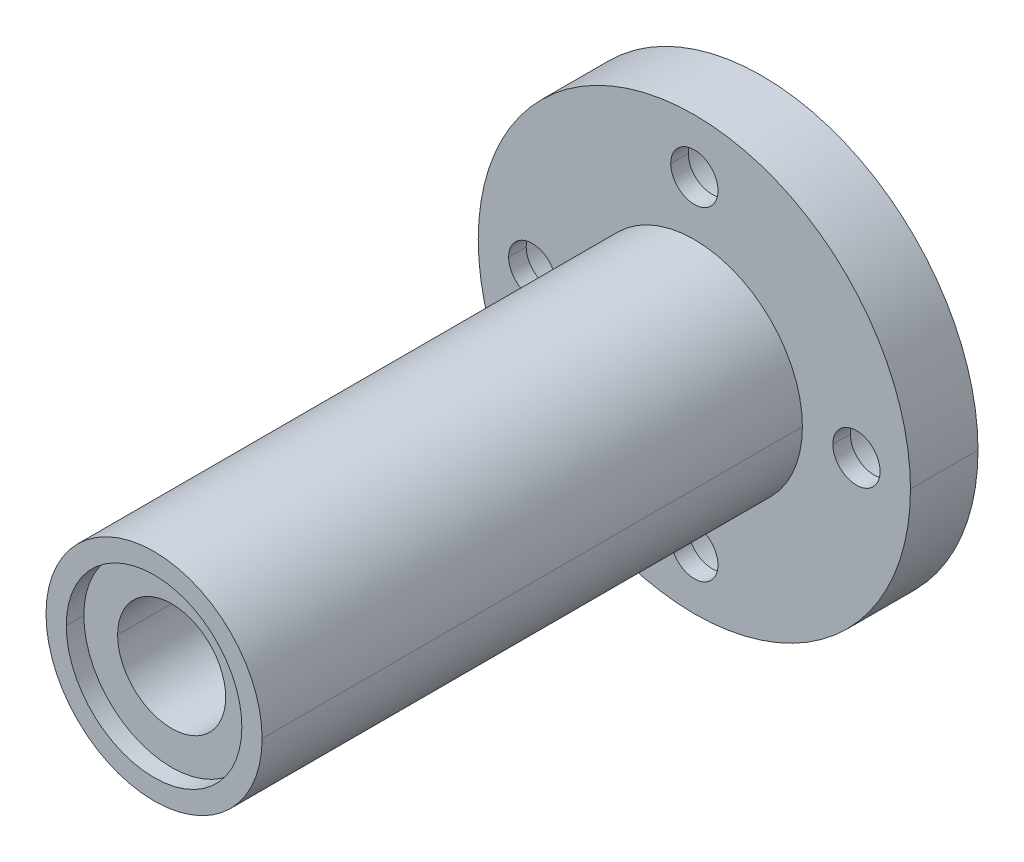
ISO-10303-21;
HEADER;
FILE_DESCRIPTION(('STEP AP214'),'2;1');
FILE_NAME('part.step','',(''),(''),'','','');
FILE_SCHEMA(('AUTOMOTIVE_DESIGN { 1 0 10303 214 1 1 1 1 }'));
ENDSEC;
DATA;
#1=APPLICATION_CONTEXT('core data for automotive mechanical design processes');
#2=APPLICATION_PROTOCOL_DEFINITION('international standard','automotive_design',2000,#1);
#3=PRODUCT_CONTEXT('',#1,'mechanical');
#4=PRODUCT('Part','Part','',(#3));
#5=PRODUCT_RELATED_PRODUCT_CATEGORY('part','',(#4));
#6=PRODUCT_DEFINITION_FORMATION('','',#4);
#7=PRODUCT_DEFINITION_CONTEXT('part definition',#1,'design');
#8=PRODUCT_DEFINITION('design','',#6,#7);
#9=PRODUCT_DEFINITION_SHAPE('','',#8);
#10=(LENGTH_UNIT() NAMED_UNIT(*) SI_UNIT(.MILLI.,.METRE.));
#11=(NAMED_UNIT(*) PLANE_ANGLE_UNIT() SI_UNIT($,.RADIAN.));
#12=(NAMED_UNIT(*) SI_UNIT($,.STERADIAN.) SOLID_ANGLE_UNIT());
#13=UNCERTAINTY_MEASURE_WITH_UNIT(LENGTH_MEASURE(1.E-05),#10,'distance_accuracy_value','');
#14=(GEOMETRIC_REPRESENTATION_CONTEXT(3) GLOBAL_UNCERTAINTY_ASSIGNED_CONTEXT((#13)) GLOBAL_UNIT_ASSIGNED_CONTEXT((#10,
#11,#12)) REPRESENTATION_CONTEXT('',''));
#15=CARTESIAN_POINT('',(0.,0.,0.));
#16=DIRECTION('',(0.,0.,1.));
#17=DIRECTION('',(1.,0.,0.));
#18=AXIS2_PLACEMENT_3D('',#15,#16,#17);
#19=CARTESIAN_POINT('',(12.,0.,0.));
#20=DIRECTION('',(0.,0.,-1.));
#21=DIRECTION('',(-1.,0.,0.));
#22=AXIS2_PLACEMENT_3D('',#19,#20,#21);
#23=CYLINDRICAL_SURFACE('',#22,3.25);
#24=DIRECTION('',(0.,0.,-1.));
#25=VECTOR('',#24,1.);
#26=CARTESIAN_POINT('',(15.25,0.,0.));
#27=LINE('',#26,#25);
#28=CARTESIAN_POINT('',(15.25,0.,3.7));
#29=VERTEX_POINT('',#28);
#30=CARTESIAN_POINT('',(15.25,0.,0.));
#31=VERTEX_POINT('',#30);
#32=EDGE_CURVE('E406',#29,#31,#27,.T.);
#33=ORIENTED_EDGE('',*,*,#32,.F.);
#34=CARTESIAN_POINT('',(12.,0.,3.7));
#35=DIRECTION('',(0.,0.,-1.));
#36=DIRECTION('',(-1.,0.,0.));
#37=AXIS2_PLACEMENT_3D('',#34,#35,#36);
#38=CIRCLE('',#37,3.25);
#39=CARTESIAN_POINT('',(8.75,0.,3.7));
#40=VERTEX_POINT('',#39);
#41=EDGE_CURVE('E10',#40,#29,#38,.T.);
#42=ORIENTED_EDGE('',*,*,#41,.F.);
#43=DIRECTION('',(0.,0.,-1.));
#44=VECTOR('',#43,1.);
#45=CARTESIAN_POINT('',(8.75,0.,0.));
#46=LINE('',#45,#44);
#47=CARTESIAN_POINT('',(8.75,0.,0.));
#48=VERTEX_POINT('',#47);
#49=EDGE_CURVE('E317',#40,#48,#46,.T.);
#50=ORIENTED_EDGE('',*,*,#49,.T.);
#51=CARTESIAN_POINT('',(12.,0.,0.));
#52=DIRECTION('',(0.,0.,-1.));
#53=DIRECTION('',(-1.,0.,0.));
#54=AXIS2_PLACEMENT_3D('',#51,#52,#53);
#55=CIRCLE('',#54,3.25);
#56=EDGE_CURVE('E410',#48,#31,#55,.T.);
#57=ORIENTED_EDGE('',*,*,#56,.T.);
#58=EDGE_LOOP('',(#33,#42,#50,#57));
#59=FACE_BOUND('',#58,.T.);
#60=ADVANCED_FACE('F15',(#59),#23,.F.);
#61=CARTESIAN_POINT('',(13.75,0.,3.7));
#62=DIRECTION('',(0.,0.,1.));
#63=DIRECTION('',(1.,0.,0.));
#64=AXIS2_PLACEMENT_3D('',#61,#62,#63);
#65=PLANE('',#64);
#66=CARTESIAN_POINT('',(12.,0.,3.7));
#67=DIRECTION('',(0.,0.,-1.));
#68=DIRECTION('',(-1.,0.,0.));
#69=AXIS2_PLACEMENT_3D('',#66,#67,#68);
#70=CIRCLE('',#69,1.75);
#71=CARTESIAN_POINT('',(10.25,0.,3.7));
#72=VERTEX_POINT('',#71);
#73=CARTESIAN_POINT('',(13.75,0.,3.7));
#74=VERTEX_POINT('',#73);
#75=EDGE_CURVE('E26',#72,#74,#70,.T.);
#76=ORIENTED_EDGE('',*,*,#75,.F.);
#77=CARTESIAN_POINT('',(12.,0.,3.7));
#78=DIRECTION('',(0.,0.,-1.));
#79=DIRECTION('',(-1.,0.,0.));
#80=AXIS2_PLACEMENT_3D('',#77,#78,#79);
#81=CIRCLE('',#80,1.75);
#82=EDGE_CURVE('E436',#74,#72,#81,.T.);
#83=ORIENTED_EDGE('',*,*,#82,.F.);
#84=EDGE_LOOP('',(#76,#83));
#85=FACE_BOUND('',#84,.T.);
#86=ORIENTED_EDGE('',*,*,#41,.T.);
#87=CARTESIAN_POINT('',(12.,0.,3.7));
#88=DIRECTION('',(0.,0.,-1.));
#89=DIRECTION('',(-1.,0.,0.));
#90=AXIS2_PLACEMENT_3D('',#87,#88,#89);
#91=CIRCLE('',#90,3.25);
#92=EDGE_CURVE('E450',#29,#40,#91,.T.);
#93=ORIENTED_EDGE('',*,*,#92,.T.);
#94=EDGE_LOOP('',(#86,#93));
#95=FACE_BOUND('',#94,.T.);
#96=ADVANCED_FACE('F831',(#85,#95),#65,.F.);
#97=CARTESIAN_POINT('',(12.,0.,0.));
#98=DIRECTION('',(0.,0.,-1.));
#99=DIRECTION('',(-1.,0.,0.));
#100=AXIS2_PLACEMENT_3D('',#97,#98,#99);
#101=CYLINDRICAL_SURFACE('',#100,1.75);
#102=DIRECTION('',(0.,0.,-1.));
#103=VECTOR('',#102,1.);
#104=CARTESIAN_POINT('',(13.75,0.,0.));
#105=LINE('',#104,#103);
#106=CARTESIAN_POINT('',(13.75,0.,5.));
#107=VERTEX_POINT('',#106);
#108=EDGE_CURVE('E440',#107,#74,#105,.T.);
#109=ORIENTED_EDGE('',*,*,#108,.F.);
#110=CARTESIAN_POINT('',(12.,0.,5.));
#111=DIRECTION('',(0.,0.,1.));
#112=DIRECTION('',(1.,0.,0.));
#113=AXIS2_PLACEMENT_3D('',#110,#111,#112);
#114=CIRCLE('',#113,1.75);
#115=CARTESIAN_POINT('',(10.25,0.,5.));
#116=VERTEX_POINT('',#115);
#117=EDGE_CURVE('E242',#107,#116,#114,.T.);
#118=ORIENTED_EDGE('',*,*,#117,.T.);
#119=DIRECTION('',(0.,0.,-1.));
#120=VECTOR('',#119,1.);
#121=CARTESIAN_POINT('',(10.25,0.,0.));
#122=LINE('',#121,#120);
#123=EDGE_CURVE('E316',#116,#72,#122,.T.);
#124=ORIENTED_EDGE('',*,*,#123,.T.);
#125=ORIENTED_EDGE('',*,*,#75,.T.);
#126=EDGE_LOOP('',(#109,#118,#124,#125));
#127=FACE_BOUND('',#126,.T.);
#128=ADVANCED_FACE('F882',(#127),#101,.F.);
#129=CARTESIAN_POINT('',(0.,-12.,0.));
#130=DIRECTION('',(0.,0.,-1.));
#131=DIRECTION('',(-1.,0.,0.));
#132=AXIS2_PLACEMENT_3D('',#129,#130,#131);
#133=CYLINDRICAL_SURFACE('',#132,3.25);
#134=DIRECTION('',(0.,0.,-1.));
#135=VECTOR('',#134,1.);
#136=CARTESIAN_POINT('',(3.25,-12.,0.));
#137=LINE('',#136,#135);
#138=CARTESIAN_POINT('',(3.25,-12.,3.7));
#139=VERTEX_POINT('',#138);
#140=CARTESIAN_POINT('',(3.25,-12.,0.));
#141=VERTEX_POINT('',#140);
#142=EDGE_CURVE('E315',#139,#141,#137,.T.);
#143=ORIENTED_EDGE('',*,*,#142,.F.);
#144=CARTESIAN_POINT('',(0.,-12.,3.7));
#145=DIRECTION('',(0.,0.,-1.));
#146=DIRECTION('',(-1.,0.,0.));
#147=AXIS2_PLACEMENT_3D('',#144,#145,#146);
#148=CIRCLE('',#147,3.25);
#149=CARTESIAN_POINT('',(-3.25,-12.,3.7));
#150=VERTEX_POINT('',#149);
#151=EDGE_CURVE('E377',#150,#139,#148,.T.);
#152=ORIENTED_EDGE('',*,*,#151,.F.);
#153=DIRECTION('',(0.,0.,-1.));
#154=VECTOR('',#153,1.);
#155=CARTESIAN_POINT('',(-3.25,-12.,0.));
#156=LINE('',#155,#154);
#157=CARTESIAN_POINT('',(-3.25,-12.,0.));
#158=VERTEX_POINT('',#157);
#159=EDGE_CURVE('E255',#150,#158,#156,.T.);
#160=ORIENTED_EDGE('',*,*,#159,.T.);
#161=CARTESIAN_POINT('',(0.,-12.,0.));
#162=DIRECTION('',(0.,0.,-1.));
#163=DIRECTION('',(-1.,0.,0.));
#164=AXIS2_PLACEMENT_3D('',#161,#162,#163);
#165=CIRCLE('',#164,3.25);
#166=EDGE_CURVE('E424',#158,#141,#165,.T.);
#167=ORIENTED_EDGE('',*,*,#166,.T.);
#168=EDGE_LOOP('',(#143,#152,#160,#167));
#169=FACE_BOUND('',#168,.T.);
#170=ADVANCED_FACE('F772',(#169),#133,.F.);
#171=CARTESIAN_POINT('',(1.75,-12.,3.7));
#172=DIRECTION('',(0.,0.,1.));
#173=DIRECTION('',(1.,0.,0.));
#174=AXIS2_PLACEMENT_3D('',#171,#172,#173);
#175=PLANE('',#174);
#176=CARTESIAN_POINT('',(0.,-12.,3.7));
#177=DIRECTION('',(0.,0.,-1.));
#178=DIRECTION('',(-1.,0.,0.));
#179=AXIS2_PLACEMENT_3D('',#176,#177,#178);
#180=CIRCLE('',#179,1.75);
#181=CARTESIAN_POINT('',(-1.75,-12.,3.7));
#182=VERTEX_POINT('',#181);
#183=CARTESIAN_POINT('',(1.75,-12.,3.7));
#184=VERTEX_POINT('',#183);
#185=EDGE_CURVE('E246',#182,#184,#180,.T.);
#186=ORIENTED_EDGE('',*,*,#185,.F.);
#187=CARTESIAN_POINT('',(0.,-12.,3.7));
#188=DIRECTION('',(0.,0.,-1.));
#189=DIRECTION('',(-1.,0.,0.));
#190=AXIS2_PLACEMENT_3D('',#187,#188,#189);
#191=CIRCLE('',#190,1.75);
#192=EDGE_CURVE('E251',#184,#182,#191,.T.);
#193=ORIENTED_EDGE('',*,*,#192,.F.);
#194=EDGE_LOOP('',(#186,#193));
#195=FACE_BOUND('',#194,.T.);
#196=ORIENTED_EDGE('',*,*,#151,.T.);
#197=CARTESIAN_POINT('',(0.,-12.,3.7));
#198=DIRECTION('',(0.,0.,-1.));
#199=DIRECTION('',(-1.,0.,0.));
#200=AXIS2_PLACEMENT_3D('',#197,#198,#199);
#201=CIRCLE('',#200,3.25);
#202=EDGE_CURVE('E311',#139,#150,#201,.T.);
#203=ORIENTED_EDGE('',*,*,#202,.T.);
#204=EDGE_LOOP('',(#196,#203));
#205=FACE_BOUND('',#204,.T.);
#206=ADVANCED_FACE('F768',(#195,#205),#175,.F.);
#207=CARTESIAN_POINT('',(0.,-12.,0.));
#208=DIRECTION('',(0.,0.,-1.));
#209=DIRECTION('',(-1.,0.,0.));
#210=AXIS2_PLACEMENT_3D('',#207,#208,#209);
#211=CYLINDRICAL_SURFACE('',#210,1.75);
#212=DIRECTION('',(0.,0.,-1.));
#213=VECTOR('',#212,1.);
#214=CARTESIAN_POINT('',(1.75,-12.,0.));
#215=LINE('',#214,#213);
#216=CARTESIAN_POINT('',(1.75,-12.,5.));
#217=VERTEX_POINT('',#216);
#218=EDGE_CURVE('E19',#217,#184,#215,.T.);
#219=ORIENTED_EDGE('',*,*,#218,.F.);
#220=CARTESIAN_POINT('',(0.,-12.,5.));
#221=DIRECTION('',(0.,0.,1.));
#222=DIRECTION('',(1.,0.,0.));
#223=AXIS2_PLACEMENT_3D('',#220,#221,#222);
#224=CIRCLE('',#223,1.75);
#225=CARTESIAN_POINT('',(-1.75,-12.,5.));
#226=VERTEX_POINT('',#225);
#227=EDGE_CURVE('E231',#217,#226,#224,.T.);
#228=ORIENTED_EDGE('',*,*,#227,.T.);
#229=DIRECTION('',(0.,0.,-1.));
#230=VECTOR('',#229,1.);
#231=CARTESIAN_POINT('',(-1.75,-12.,0.));
#232=LINE('',#231,#230);
#233=EDGE_CURVE('E253',#226,#182,#232,.T.);
#234=ORIENTED_EDGE('',*,*,#233,.T.);
#235=ORIENTED_EDGE('',*,*,#185,.T.);
#236=EDGE_LOOP('',(#219,#228,#234,#235));
#237=FACE_BOUND('',#236,.T.);
#238=ADVANCED_FACE('F245',(#237),#211,.F.);
#239=CARTESIAN_POINT('',(-12.,0.,0.));
#240=DIRECTION('',(0.,0.,-1.));
#241=DIRECTION('',(-1.,0.,0.));
#242=AXIS2_PLACEMENT_3D('',#239,#240,#241);
#243=CYLINDRICAL_SURFACE('',#242,3.25);
#244=DIRECTION('',(0.,0.,-1.));
#245=VECTOR('',#244,1.);
#246=CARTESIAN_POINT('',(-8.75,0.,0.));
#247=LINE('',#246,#245);
#248=CARTESIAN_POINT('',(-8.75,0.,3.7));
#249=VERTEX_POINT('',#248);
#250=CARTESIAN_POINT('',(-8.75,0.,0.));
#251=VERTEX_POINT('',#250);
#252=EDGE_CURVE('E343',#249,#251,#247,.T.);
#253=ORIENTED_EDGE('',*,*,#252,.F.);
#254=CARTESIAN_POINT('',(-12.,0.,3.7));
#255=DIRECTION('',(0.,0.,-1.));
#256=DIRECTION('',(-1.,0.,0.));
#257=AXIS2_PLACEMENT_3D('',#254,#255,#256);
#258=CIRCLE('',#257,3.25);
#259=CARTESIAN_POINT('',(-15.25,0.,3.7));
#260=VERTEX_POINT('',#259);
#261=EDGE_CURVE('E336',#260,#249,#258,.T.);
#262=ORIENTED_EDGE('',*,*,#261,.F.);
#263=DIRECTION('',(0.,0.,-1.));
#264=VECTOR('',#263,1.);
#265=CARTESIAN_POINT('',(-15.25,0.,0.));
#266=LINE('',#265,#264);
#267=CARTESIAN_POINT('',(-15.25,0.,0.));
#268=VERTEX_POINT('',#267);
#269=EDGE_CURVE('E360',#260,#268,#266,.T.);
#270=ORIENTED_EDGE('',*,*,#269,.T.);
#271=CARTESIAN_POINT('',(-12.,0.,0.));
#272=DIRECTION('',(0.,0.,-1.));
#273=DIRECTION('',(-1.,0.,0.));
#274=AXIS2_PLACEMENT_3D('',#271,#272,#273);
#275=CIRCLE('',#274,3.25);
#276=EDGE_CURVE('E298',#268,#251,#275,.T.);
#277=ORIENTED_EDGE('',*,*,#276,.T.);
#278=EDGE_LOOP('',(#253,#262,#270,#277));
#279=FACE_BOUND('',#278,.T.);
#280=ADVANCED_FACE('F781',(#279),#243,.F.);
#281=CARTESIAN_POINT('',(-10.25,0.,3.7));
#282=DIRECTION('',(0.,0.,1.));
#283=DIRECTION('',(1.,0.,0.));
#284=AXIS2_PLACEMENT_3D('',#281,#282,#283);
#285=PLANE('',#284);
#286=CARTESIAN_POINT('',(-12.,0.,3.7));
#287=DIRECTION('',(0.,0.,-1.));
#288=DIRECTION('',(-1.,0.,0.));
#289=AXIS2_PLACEMENT_3D('',#286,#287,#288);
#290=CIRCLE('',#289,1.75);
#291=CARTESIAN_POINT('',(-13.75,0.,3.7));
#292=VERTEX_POINT('',#291);
#293=CARTESIAN_POINT('',(-10.25,0.,3.7));
#294=VERTEX_POINT('',#293);
#295=EDGE_CURVE('E326',#292,#294,#290,.T.);
#296=ORIENTED_EDGE('',*,*,#295,.F.);
#297=CARTESIAN_POINT('',(-12.,0.,3.7));
#298=DIRECTION('',(0.,0.,-1.));
#299=DIRECTION('',(-1.,0.,0.));
#300=AXIS2_PLACEMENT_3D('',#297,#298,#299);
#301=CIRCLE('',#300,1.75);
#302=EDGE_CURVE('E373',#294,#292,#301,.T.);
#303=ORIENTED_EDGE('',*,*,#302,.F.);
#304=EDGE_LOOP('',(#296,#303));
#305=FACE_BOUND('',#304,.T.);
#306=ORIENTED_EDGE('',*,*,#261,.T.);
#307=CARTESIAN_POINT('',(-12.,0.,3.7));
#308=DIRECTION('',(0.,0.,-1.));
#309=DIRECTION('',(-1.,0.,0.));
#310=AXIS2_PLACEMENT_3D('',#307,#308,#309);
#311=CIRCLE('',#310,3.25);
#312=EDGE_CURVE('E339',#249,#260,#311,.T.);
#313=ORIENTED_EDGE('',*,*,#312,.T.);
#314=EDGE_LOOP('',(#306,#313));
#315=FACE_BOUND('',#314,.T.);
#316=ADVANCED_FACE('F545',(#305,#315),#285,.F.);
#317=CARTESIAN_POINT('',(-12.,0.,0.));
#318=DIRECTION('',(0.,0.,-1.));
#319=DIRECTION('',(-1.,0.,0.));
#320=AXIS2_PLACEMENT_3D('',#317,#318,#319);
#321=CYLINDRICAL_SURFACE('',#320,1.75);
#322=DIRECTION('',(0.,0.,-1.));
#323=VECTOR('',#322,1.);
#324=CARTESIAN_POINT('',(-10.25,0.,0.));
#325=LINE('',#324,#323);
#326=CARTESIAN_POINT('',(-10.25,0.,5.));
#327=VERTEX_POINT('',#326);
#328=EDGE_CURVE('E359',#327,#294,#325,.T.);
#329=ORIENTED_EDGE('',*,*,#328,.F.);
#330=CARTESIAN_POINT('',(-12.,0.,5.));
#331=DIRECTION('',(0.,0.,1.));
#332=DIRECTION('',(1.,0.,0.));
#333=AXIS2_PLACEMENT_3D('',#330,#331,#332);
#334=CIRCLE('',#333,1.75);
#335=CARTESIAN_POINT('',(-13.75,0.,5.));
#336=VERTEX_POINT('',#335);
#337=EDGE_CURVE('E241',#327,#336,#334,.T.);
#338=ORIENTED_EDGE('',*,*,#337,.T.);
#339=DIRECTION('',(0.,0.,-1.));
#340=VECTOR('',#339,1.);
#341=CARTESIAN_POINT('',(-13.75,0.,0.));
#342=LINE('',#341,#340);
#343=EDGE_CURVE('E310',#336,#292,#342,.T.);
#344=ORIENTED_EDGE('',*,*,#343,.T.);
#345=ORIENTED_EDGE('',*,*,#295,.T.);
#346=EDGE_LOOP('',(#329,#338,#344,#345));
#347=FACE_BOUND('',#346,.T.);
#348=ADVANCED_FACE('F549',(#347),#321,.F.);
#349=CARTESIAN_POINT('',(0.,12.,0.));
#350=DIRECTION('',(0.,0.,-1.));
#351=DIRECTION('',(-1.,0.,0.));
#352=AXIS2_PLACEMENT_3D('',#349,#350,#351);
#353=CYLINDRICAL_SURFACE('',#352,3.25);
#354=DIRECTION('',(0.,0.,-1.));
#355=VECTOR('',#354,1.);
#356=CARTESIAN_POINT('',(3.25,12.,0.));
#357=LINE('',#356,#355);
#358=CARTESIAN_POINT('',(3.25,12.,3.7));
#359=VERTEX_POINT('',#358);
#360=CARTESIAN_POINT('',(3.25,12.,0.));
#361=VERTEX_POINT('',#360);
#362=EDGE_CURVE('E309',#359,#361,#357,.T.);
#363=ORIENTED_EDGE('',*,*,#362,.F.);
#364=CARTESIAN_POINT('',(0.,12.,3.7));
#365=DIRECTION('',(0.,0.,-1.));
#366=DIRECTION('',(-1.,0.,0.));
#367=AXIS2_PLACEMENT_3D('',#364,#365,#366);
#368=CIRCLE('',#367,3.25);
#369=CARTESIAN_POINT('',(-3.25,12.,3.7));
#370=VERTEX_POINT('',#369);
#371=EDGE_CURVE('E323',#370,#359,#368,.T.);
#372=ORIENTED_EDGE('',*,*,#371,.F.);
#373=DIRECTION('',(0.,0.,-1.));
#374=VECTOR('',#373,1.);
#375=CARTESIAN_POINT('',(-3.25,12.,0.));
#376=LINE('',#375,#374);
#377=CARTESIAN_POINT('',(-3.25,12.,0.));
#378=VERTEX_POINT('',#377);
#379=EDGE_CURVE('E277',#370,#378,#376,.T.);
#380=ORIENTED_EDGE('',*,*,#379,.T.);
#381=CARTESIAN_POINT('',(0.,12.,0.));
#382=DIRECTION('',(0.,0.,-1.));
#383=DIRECTION('',(-1.,0.,0.));
#384=AXIS2_PLACEMENT_3D('',#381,#382,#383);
#385=CIRCLE('',#384,3.25);
#386=EDGE_CURVE('E294',#378,#361,#385,.T.);
#387=ORIENTED_EDGE('',*,*,#386,.T.);
#388=EDGE_LOOP('',(#363,#372,#380,#387));
#389=FACE_BOUND('',#388,.T.);
#390=ADVANCED_FACE('F844',(#389),#353,.F.);
#391=CARTESIAN_POINT('',(1.75,12.,3.7));
#392=DIRECTION('',(0.,0.,1.));
#393=DIRECTION('',(1.,0.,0.));
#394=AXIS2_PLACEMENT_3D('',#391,#392,#393);
#395=PLANE('',#394);
#396=CARTESIAN_POINT('',(0.,12.,3.7));
#397=DIRECTION('',(0.,0.,-1.));
#398=DIRECTION('',(-1.,0.,0.));
#399=AXIS2_PLACEMENT_3D('',#396,#397,#398);
#400=CIRCLE('',#399,1.75);
#401=CARTESIAN_POINT('',(-1.75,12.,3.7));
#402=VERTEX_POINT('',#401);
#403=CARTESIAN_POINT('',(1.75,12.,3.7));
#404=VERTEX_POINT('',#403);
#405=EDGE_CURVE('E327',#402,#404,#400,.T.);
#406=ORIENTED_EDGE('',*,*,#405,.F.);
#407=CARTESIAN_POINT('',(0.,12.,3.7));
#408=DIRECTION('',(0.,0.,-1.));
#409=DIRECTION('',(-1.,0.,0.));
#410=AXIS2_PLACEMENT_3D('',#407,#408,#409);
#411=CIRCLE('',#410,1.75);
#412=EDGE_CURVE('E389',#404,#402,#411,.T.);
#413=ORIENTED_EDGE('',*,*,#412,.F.);
#414=EDGE_LOOP('',(#406,#413));
#415=FACE_BOUND('',#414,.T.);
#416=ORIENTED_EDGE('',*,*,#371,.T.);
#417=CARTESIAN_POINT('',(0.,12.,3.7));
#418=DIRECTION('',(0.,0.,-1.));
#419=DIRECTION('',(-1.,0.,0.));
#420=AXIS2_PLACEMENT_3D('',#417,#418,#419);
#421=CIRCLE('',#420,3.25);
#422=EDGE_CURVE('E305',#359,#370,#421,.T.);
#423=ORIENTED_EDGE('',*,*,#422,.T.);
#424=EDGE_LOOP('',(#416,#423));
#425=FACE_BOUND('',#424,.T.);
#426=ADVANCED_FACE('F848',(#415,#425),#395,.F.);
#427=CARTESIAN_POINT('',(0.,12.,0.));
#428=DIRECTION('',(0.,0.,-1.));
#429=DIRECTION('',(-1.,0.,0.));
#430=AXIS2_PLACEMENT_3D('',#427,#428,#429);
#431=CYLINDRICAL_SURFACE('',#430,1.75);
#432=DIRECTION('',(0.,0.,-1.));
#433=VECTOR('',#432,1.);
#434=CARTESIAN_POINT('',(1.75,12.,0.));
#435=LINE('',#434,#433);
#436=CARTESIAN_POINT('',(1.75,12.,5.));
#437=VERTEX_POINT('',#436);
#438=EDGE_CURVE('E276',#437,#404,#435,.T.);
#439=ORIENTED_EDGE('',*,*,#438,.F.);
#440=CARTESIAN_POINT('',(0.,12.,5.));
#441=DIRECTION('',(0.,0.,1.));
#442=DIRECTION('',(1.,0.,0.));
#443=AXIS2_PLACEMENT_3D('',#440,#441,#442);
#444=CIRCLE('',#443,1.75);
#445=CARTESIAN_POINT('',(-1.75,12.,5.));
#446=VERTEX_POINT('',#445);
#447=EDGE_CURVE('E301',#437,#446,#444,.T.);
#448=ORIENTED_EDGE('',*,*,#447,.T.);
#449=DIRECTION('',(0.,0.,-1.));
#450=VECTOR('',#449,1.);
#451=CARTESIAN_POINT('',(-1.75,12.,0.));
#452=LINE('',#451,#450);
#453=EDGE_CURVE('E333',#446,#402,#452,.T.);
#454=ORIENTED_EDGE('',*,*,#453,.T.);
#455=ORIENTED_EDGE('',*,*,#405,.T.);
#456=EDGE_LOOP('',(#439,#448,#454,#455));
#457=FACE_BOUND('',#456,.T.);
#458=ADVANCED_FACE('F17',(#457),#431,.F.);
#459=CARTESIAN_POINT('',(4.,0.,1.3));
#460=DIRECTION('',(0.,0.,1.));
#461=DIRECTION('',(1.,0.,0.));
#462=AXIS2_PLACEMENT_3D('',#459,#460,#461);
#463=PLANE('',#462);
#464=CARTESIAN_POINT('',(0.,0.,1.3));
#465=DIRECTION('',(0.,0.,1.));
#466=DIRECTION('',(1.,0.,0.));
#467=AXIS2_PLACEMENT_3D('',#464,#465,#466);
#468=CIRCLE('',#467,4.);
#469=CARTESIAN_POINT('',(4.,0.,1.3));
#470=VERTEX_POINT('',#469);
#471=CARTESIAN_POINT('',(-4.,0.,1.3));
#472=VERTEX_POINT('',#471);
#473=EDGE_CURVE('E190',#470,#472,#468,.T.);
#474=ORIENTED_EDGE('',*,*,#473,.T.);
#475=CARTESIAN_POINT('',(0.,0.,1.3));
#476=DIRECTION('',(0.,0.,1.));
#477=DIRECTION('',(1.,0.,0.));
#478=AXIS2_PLACEMENT_3D('',#475,#476,#477);
#479=CIRCLE('',#478,4.);
#480=EDGE_CURVE('E328',#472,#470,#479,.T.);
#481=ORIENTED_EDGE('',*,*,#480,.T.);
#482=EDGE_LOOP('',(#474,#481));
#483=FACE_BOUND('',#482,.T.);
#484=CARTESIAN_POINT('',(0.,0.,1.3));
#485=DIRECTION('',(0.,0.,1.));
#486=DIRECTION('',(1.,0.,0.));
#487=AXIS2_PLACEMENT_3D('',#484,#485,#486);
#488=CIRCLE('',#487,6.5);
#489=CARTESIAN_POINT('',(6.5,0.,1.3));
#490=VERTEX_POINT('',#489);
#491=CARTESIAN_POINT('',(-6.5,0.,1.3));
#492=VERTEX_POINT('',#491);
#493=EDGE_CURVE('E282',#490,#492,#488,.T.);
#494=ORIENTED_EDGE('',*,*,#493,.F.);
#495=CARTESIAN_POINT('',(0.,0.,1.3));
#496=DIRECTION('',(0.,0.,1.));
#497=DIRECTION('',(1.,0.,0.));
#498=AXIS2_PLACEMENT_3D('',#495,#496,#497);
#499=CIRCLE('',#498,6.5);
#500=EDGE_CURVE('E347',#492,#490,#499,.T.);
#501=ORIENTED_EDGE('',*,*,#500,.F.);
#502=EDGE_LOOP('',(#494,#501));
#503=FACE_BOUND('',#502,.T.);
#504=ADVANCED_FACE('F936',(#483,#503),#463,.F.);
#505=CARTESIAN_POINT('',(0.,0.,0.));
#506=DIRECTION('',(0.,0.,1.));
#507=DIRECTION('',(1.,0.,0.));
#508=AXIS2_PLACEMENT_3D('',#505,#506,#507);
#509=CYLINDRICAL_SURFACE('',#508,4.);
#510=DIRECTION('',(0.,0.,1.));
#511=VECTOR('',#510,1.);
#512=CARTESIAN_POINT('',(-4.,0.,0.));
#513=LINE('',#512,#511);
#514=CARTESIAN_POINT('',(-4.,0.,43.7));
#515=VERTEX_POINT('',#514);
#516=EDGE_CURVE('E332',#472,#515,#513,.T.);
#517=ORIENTED_EDGE('',*,*,#516,.F.);
#518=ORIENTED_EDGE('',*,*,#473,.F.);
#519=DIRECTION('',(0.,0.,1.));
#520=VECTOR('',#519,1.);
#521=CARTESIAN_POINT('',(4.,0.,0.));
#522=LINE('',#521,#520);
#523=CARTESIAN_POINT('',(4.,0.,43.7));
#524=VERTEX_POINT('',#523);
#525=EDGE_CURVE('E417',#470,#524,#522,.T.);
#526=ORIENTED_EDGE('',*,*,#525,.T.);
#527=CARTESIAN_POINT('',(0.,0.,43.7));
#528=DIRECTION('',(0.,0.,1.));
#529=DIRECTION('',(1.,0.,0.));
#530=AXIS2_PLACEMENT_3D('',#527,#528,#529);
#531=CIRCLE('',#530,4.);
#532=EDGE_CURVE('E179',#524,#515,#531,.T.);
#533=ORIENTED_EDGE('',*,*,#532,.T.);
#534=EDGE_LOOP('',(#517,#518,#526,#533));
#535=FACE_BOUND('',#534,.T.);
#536=ADVANCED_FACE('F940',(#535),#509,.F.);
#537=CARTESIAN_POINT('',(6.5,0.,43.7));
#538=DIRECTION('',(0.,0.,-1.));
#539=DIRECTION('',(0.,-1.,0.));
#540=AXIS2_PLACEMENT_3D('',#537,#538,#539);
#541=PLANE('',#540);
#542=ORIENTED_EDGE('',*,*,#532,.F.);
#543=CARTESIAN_POINT('',(0.,0.,43.7));
#544=DIRECTION('',(0.,0.,1.));
#545=DIRECTION('',(1.,0.,0.));
#546=AXIS2_PLACEMENT_3D('',#543,#544,#545);
#547=CIRCLE('',#546,4.);
#548=EDGE_CURVE('E420',#515,#524,#547,.T.);
#549=ORIENTED_EDGE('',*,*,#548,.F.);
#550=EDGE_LOOP('',(#542,#549));
#551=FACE_BOUND('',#550,.T.);
#552=CARTESIAN_POINT('',(0.,0.,43.7));
#553=DIRECTION('',(0.,0.,1.));
#554=DIRECTION('',(1.,0.,0.));
#555=AXIS2_PLACEMENT_3D('',#552,#553,#554);
#556=CIRCLE('',#555,6.5);
#557=CARTESIAN_POINT('',(6.5,0.,43.7));
#558=VERTEX_POINT('',#557);
#559=CARTESIAN_POINT('',(-6.5,0.,43.7));
#560=VERTEX_POINT('',#559);
#561=EDGE_CURVE('E278',#558,#560,#556,.T.);
#562=ORIENTED_EDGE('',*,*,#561,.T.);
#563=CARTESIAN_POINT('',(0.,0.,43.7));
#564=DIRECTION('',(0.,0.,1.));
#565=DIRECTION('',(1.,0.,0.));
#566=AXIS2_PLACEMENT_3D('',#563,#564,#565);
#567=CIRCLE('',#566,6.5);
#568=EDGE_CURVE('E419',#560,#558,#567,.T.);
#569=ORIENTED_EDGE('',*,*,#568,.T.);
#570=EDGE_LOOP('',(#562,#569));
#571=FACE_BOUND('',#570,.T.);
#572=ADVANCED_FACE('F741',(#551,#571),#541,.F.);
#573=CARTESIAN_POINT('',(0.,0.,0.));
#574=DIRECTION('',(0.,0.,1.));
#575=DIRECTION('',(1.,0.,0.));
#576=AXIS2_PLACEMENT_3D('',#573,#574,#575);
#577=CYLINDRICAL_SURFACE('',#576,6.5);
#578=DIRECTION('',(0.,0.,1.));
#579=VECTOR('',#578,1.);
#580=CARTESIAN_POINT('',(-6.5,0.,0.));
#581=LINE('',#580,#579);
#582=CARTESIAN_POINT('',(-6.5,0.,45.));
#583=VERTEX_POINT('',#582);
#584=EDGE_CURVE('E492',#560,#583,#581,.T.);
#585=ORIENTED_EDGE('',*,*,#584,.F.);
#586=ORIENTED_EDGE('',*,*,#561,.F.);
#587=DIRECTION('',(0.,0.,1.));
#588=VECTOR('',#587,1.);
#589=CARTESIAN_POINT('',(6.5,0.,0.));
#590=LINE('',#589,#588);
#591=CARTESIAN_POINT('',(6.5,0.,45.));
#592=VERTEX_POINT('',#591);
#593=EDGE_CURVE('E288',#558,#592,#590,.T.);
#594=ORIENTED_EDGE('',*,*,#593,.T.);
#595=CARTESIAN_POINT('',(0.,0.,45.));
#596=DIRECTION('',(0.,0.,1.));
#597=DIRECTION('',(1.,0.,0.));
#598=AXIS2_PLACEMENT_3D('',#595,#596,#597);
#599=CIRCLE('',#598,6.5);
#600=EDGE_CURVE('E351',#592,#583,#599,.T.);
#601=ORIENTED_EDGE('',*,*,#600,.T.);
#602=EDGE_LOOP('',(#585,#586,#594,#601));
#603=FACE_BOUND('',#602,.T.);
#604=ADVANCED_FACE('F737',(#603),#577,.F.);
#605=CARTESIAN_POINT('',(0.,0.,0.));
#606=DIRECTION('',(0.,0.,1.));
#607=DIRECTION('',(1.,0.,0.));
#608=AXIS2_PLACEMENT_3D('',#605,#606,#607);
#609=CYLINDRICAL_SURFACE('',#608,6.5);
#610=DIRECTION('',(0.,0.,1.));
#611=VECTOR('',#610,1.);
#612=CARTESIAN_POINT('',(-6.5,0.,0.));
#613=LINE('',#612,#611);
#614=CARTESIAN_POINT('',(-6.5,0.,0.));
#615=VERTEX_POINT('',#614);
#616=EDGE_CURVE('E287',#615,#492,#613,.T.);
#617=ORIENTED_EDGE('',*,*,#616,.F.);
#618=CARTESIAN_POINT('',(0.,0.,0.));
#619=DIRECTION('',(0.,0.,1.));
#620=DIRECTION('',(1.,0.,0.));
#621=AXIS2_PLACEMENT_3D('',#618,#619,#620);
#622=CIRCLE('',#621,6.5);
#623=CARTESIAN_POINT('',(6.5,0.,0.));
#624=VERTEX_POINT('',#623);
#625=EDGE_CURVE('E297',#624,#615,#622,.T.);
#626=ORIENTED_EDGE('',*,*,#625,.F.);
#627=DIRECTION('',(0.,0.,1.));
#628=VECTOR('',#627,1.);
#629=CARTESIAN_POINT('',(6.5,0.,0.));
#630=LINE('',#629,#628);
#631=EDGE_CURVE('E452',#624,#490,#630,.T.);
#632=ORIENTED_EDGE('',*,*,#631,.T.);
#633=ORIENTED_EDGE('',*,*,#493,.T.);
#634=EDGE_LOOP('',(#617,#626,#632,#633));
#635=FACE_BOUND('',#634,.T.);
#636=ADVANCED_FACE('F722',(#635),#609,.F.);
#637=CARTESIAN_POINT('',(0.,0.,45.));
#638=DIRECTION('',(0.,0.,1.));
#639=DIRECTION('',(1.,0.,0.));
#640=AXIS2_PLACEMENT_3D('',#637,#638,#639);
#641=PLANE('',#640);
#642=ORIENTED_EDGE('',*,*,#600,.F.);
#643=CARTESIAN_POINT('',(0.,0.,45.));
#644=DIRECTION('',(0.,0.,1.));
#645=DIRECTION('',(1.,0.,0.));
#646=AXIS2_PLACEMENT_3D('',#643,#644,#645);
#647=CIRCLE('',#646,6.5);
#648=EDGE_CURVE('E399',#583,#592,#647,.T.);
#649=ORIENTED_EDGE('',*,*,#648,.F.);
#650=EDGE_LOOP('',(#642,#649));
#651=FACE_BOUND('',#650,.T.);
#652=CARTESIAN_POINT('',(0.,0.,45.));
#653=DIRECTION('',(0.,0.,1.));
#654=DIRECTION('',(1.,0.,0.));
#655=AXIS2_PLACEMENT_3D('',#652,#653,#654);
#656=CIRCLE('',#655,8.);
#657=CARTESIAN_POINT('',(-8.,0.,45.));
#658=VERTEX_POINT('',#657);
#659=CARTESIAN_POINT('',(8.,0.,45.));
#660=VERTEX_POINT('',#659);
#661=EDGE_CURVE('E413',#658,#660,#656,.T.);
#662=ORIENTED_EDGE('',*,*,#661,.T.);
#663=CARTESIAN_POINT('',(0.,0.,45.));
#664=DIRECTION('',(0.,0.,1.));
#665=DIRECTION('',(1.,0.,0.));
#666=AXIS2_PLACEMENT_3D('',#663,#664,#665);
#667=CIRCLE('',#666,8.);
#668=EDGE_CURVE('E385',#660,#658,#667,.T.);
#669=ORIENTED_EDGE('',*,*,#668,.T.);
#670=EDGE_LOOP('',(#662,#669));
#671=FACE_BOUND('',#670,.T.);
#672=ADVANCED_FACE('F717',(#651,#671),#641,.T.);
#673=CARTESIAN_POINT('',(0.,0.,45.));
#674=DIRECTION('',(0.,0.,-1.));
#675=DIRECTION('',(-1.,0.,0.));
#676=AXIS2_PLACEMENT_3D('',#673,#674,#675);
#677=CYLINDRICAL_SURFACE('',#676,8.);
#678=DIRECTION('',(0.,0.,-1.));
#679=VECTOR('',#678,1.);
#680=CARTESIAN_POINT('',(8.,0.,45.));
#681=LINE('',#680,#679);
#682=CARTESIAN_POINT('',(8.,0.,5.));
#683=VERTEX_POINT('',#682);
#684=EDGE_CURVE('E380',#660,#683,#681,.T.);
#685=ORIENTED_EDGE('',*,*,#684,.F.);
#686=ORIENTED_EDGE('',*,*,#661,.F.);
#687=DIRECTION('',(0.,0.,-1.));
#688=VECTOR('',#687,1.);
#689=CARTESIAN_POINT('',(-8.,0.,45.));
#690=LINE('',#689,#688);
#691=CARTESIAN_POINT('',(-8.,0.,5.));
#692=VERTEX_POINT('',#691);
#693=EDGE_CURVE('E293',#658,#692,#690,.T.);
#694=ORIENTED_EDGE('',*,*,#693,.T.);
#695=CARTESIAN_POINT('',(0.,0.,5.));
#696=DIRECTION('',(0.,0.,1.));
#697=DIRECTION('',(1.,0.,0.));
#698=AXIS2_PLACEMENT_3D('',#695,#696,#697);
#699=CIRCLE('',#698,8.);
#700=EDGE_CURVE('E304',#692,#683,#699,.T.);
#701=ORIENTED_EDGE('',*,*,#700,.T.);
#702=EDGE_LOOP('',(#685,#686,#694,#701));
#703=FACE_BOUND('',#702,.T.);
#704=ADVANCED_FACE('F721',(#703),#677,.T.);
#705=CARTESIAN_POINT('',(0.,0.,0.));
#706=DIRECTION('',(0.,0.,-1.));
#707=DIRECTION('',(0.,-1.,0.));
#708=AXIS2_PLACEMENT_3D('',#705,#706,#707);
#709=PLANE('',#708);
#710=ORIENTED_EDGE('',*,*,#625,.T.);
#711=CARTESIAN_POINT('',(0.,0.,0.));
#712=DIRECTION('',(0.,0.,1.));
#713=DIRECTION('',(1.,0.,0.));
#714=AXIS2_PLACEMENT_3D('',#711,#712,#713);
#715=CIRCLE('',#714,6.5);
#716=EDGE_CURVE('E283',#615,#624,#715,.T.);
#717=ORIENTED_EDGE('',*,*,#716,.T.);
#718=EDGE_LOOP('',(#710,#717));
#719=FACE_BOUND('',#718,.T.);
#720=ORIENTED_EDGE('',*,*,#386,.F.);
#721=CARTESIAN_POINT('',(0.,12.,0.));
#722=DIRECTION('',(0.,0.,-1.));
#723=DIRECTION('',(-1.,0.,0.));
#724=AXIS2_PLACEMENT_3D('',#721,#722,#723);
#725=CIRCLE('',#724,3.25);
#726=EDGE_CURVE('E392',#361,#378,#725,.T.);
#727=ORIENTED_EDGE('',*,*,#726,.F.);
#728=EDGE_LOOP('',(#720,#727));
#729=FACE_BOUND('',#728,.T.);
#730=ORIENTED_EDGE('',*,*,#276,.F.);
#731=CARTESIAN_POINT('',(-12.,0.,0.));
#732=DIRECTION('',(0.,0.,-1.));
#733=DIRECTION('',(-1.,0.,0.));
#734=AXIS2_PLACEMENT_3D('',#731,#732,#733);
#735=CIRCLE('',#734,3.25);
#736=EDGE_CURVE('E366',#251,#268,#735,.T.);
#737=ORIENTED_EDGE('',*,*,#736,.F.);
#738=EDGE_LOOP('',(#730,#737));
#739=FACE_BOUND('',#738,.T.);
#740=ORIENTED_EDGE('',*,*,#166,.F.);
#741=CARTESIAN_POINT('',(0.,-12.,0.));
#742=DIRECTION('',(0.,0.,-1.));
#743=DIRECTION('',(-1.,0.,0.));
#744=AXIS2_PLACEMENT_3D('',#741,#742,#743);
#745=CIRCLE('',#744,3.25);
#746=EDGE_CURVE('E263',#141,#158,#745,.T.);
#747=ORIENTED_EDGE('',*,*,#746,.F.);
#748=EDGE_LOOP('',(#740,#747));
#749=FACE_BOUND('',#748,.T.);
#750=ORIENTED_EDGE('',*,*,#56,.F.);
#751=CARTESIAN_POINT('',(12.,0.,0.));
#752=DIRECTION('',(0.,0.,-1.));
#753=DIRECTION('',(-1.,0.,0.));
#754=AXIS2_PLACEMENT_3D('',#751,#752,#753);
#755=CIRCLE('',#754,3.25);
#756=EDGE_CURVE('E322',#31,#48,#755,.T.);
#757=ORIENTED_EDGE('',*,*,#756,.F.);
#758=EDGE_LOOP('',(#750,#757));
#759=FACE_BOUND('',#758,.T.);
#760=CARTESIAN_POINT('',(0.,0.,0.));
#761=DIRECTION('',(0.,0.,-1.));
#762=DIRECTION('',(-1.,0.,0.));
#763=AXIS2_PLACEMENT_3D('',#760,#761,#762);
#764=CIRCLE('',#763,16.);
#765=CARTESIAN_POINT('',(-16.,0.,0.));
#766=VERTEX_POINT('',#765);
#767=CARTESIAN_POINT('',(16.,0.,0.));
#768=VERTEX_POINT('',#767);
#769=EDGE_CURVE('E268',#766,#768,#764,.T.);
#770=ORIENTED_EDGE('',*,*,#769,.T.);
#771=CARTESIAN_POINT('',(0.,0.,0.));
#772=DIRECTION('',(0.,0.,-1.));
#773=DIRECTION('',(-1.,0.,0.));
#774=AXIS2_PLACEMENT_3D('',#771,#772,#773);
#775=CIRCLE('',#774,16.);
#776=EDGE_CURVE('E40',#768,#766,#775,.T.);
#777=ORIENTED_EDGE('',*,*,#776,.T.);
#778=EDGE_LOOP('',(#770,#777));
#779=FACE_BOUND('',#778,.T.);
#780=ADVANCED_FACE('F731',(#719,#729,#739,#749,#759,#779),#709,.T.);
#781=CARTESIAN_POINT('',(16.,0.,5.));
#782=DIRECTION('',(0.,0.,1.));
#783=DIRECTION('',(1.,0.,0.));
#784=AXIS2_PLACEMENT_3D('',#781,#782,#783);
#785=PLANE('',#784);
#786=ORIENTED_EDGE('',*,*,#700,.F.);
#787=CARTESIAN_POINT('',(0.,0.,5.));
#788=DIRECTION('',(0.,0.,1.));
#789=DIRECTION('',(1.,0.,0.));
#790=AXIS2_PLACEMENT_3D('',#787,#788,#789);
#791=CIRCLE('',#790,8.);
#792=EDGE_CURVE('E384',#683,#692,#791,.T.);
#793=ORIENTED_EDGE('',*,*,#792,.F.);
#794=EDGE_LOOP('',(#786,#793));
#795=FACE_BOUND('',#794,.T.);
#796=CARTESIAN_POINT('',(0.,12.,5.));
#797=DIRECTION('',(0.,0.,1.));
#798=DIRECTION('',(1.,0.,0.));
#799=AXIS2_PLACEMENT_3D('',#796,#797,#798);
#800=CIRCLE('',#799,1.75);
#801=EDGE_CURVE('E272',#446,#437,#800,.T.);
#802=ORIENTED_EDGE('',*,*,#801,.F.);
#803=ORIENTED_EDGE('',*,*,#447,.F.);
#804=EDGE_LOOP('',(#802,#803));
#805=FACE_BOUND('',#804,.T.);
#806=CARTESIAN_POINT('',(-12.,0.,5.));
#807=DIRECTION('',(0.,0.,1.));
#808=DIRECTION('',(1.,0.,0.));
#809=AXIS2_PLACEMENT_3D('',#806,#807,#808);
#810=CIRCLE('',#809,1.75);
#811=EDGE_CURVE('E355',#336,#327,#810,.T.);
#812=ORIENTED_EDGE('',*,*,#811,.F.);
#813=ORIENTED_EDGE('',*,*,#337,.F.);
#814=EDGE_LOOP('',(#812,#813));
#815=FACE_BOUND('',#814,.T.);
#816=CARTESIAN_POINT('',(0.,-12.,5.));
#817=DIRECTION('',(0.,0.,1.));
#818=DIRECTION('',(1.,0.,0.));
#819=AXIS2_PLACEMENT_3D('',#816,#817,#818);
#820=CIRCLE('',#819,1.75);
#821=EDGE_CURVE('E236',#226,#217,#820,.T.);
#822=ORIENTED_EDGE('',*,*,#821,.F.);
#823=ORIENTED_EDGE('',*,*,#227,.F.);
#824=EDGE_LOOP('',(#822,#823));
#825=FACE_BOUND('',#824,.T.);
#826=CARTESIAN_POINT('',(12.,0.,5.));
#827=DIRECTION('',(0.,0.,1.));
#828=DIRECTION('',(1.,0.,0.));
#829=AXIS2_PLACEMENT_3D('',#826,#827,#828);
#830=CIRCLE('',#829,1.75);
#831=EDGE_CURVE('E321',#116,#107,#830,.T.);
#832=ORIENTED_EDGE('',*,*,#831,.F.);
#833=ORIENTED_EDGE('',*,*,#117,.F.);
#834=EDGE_LOOP('',(#832,#833));
#835=FACE_BOUND('',#834,.T.);
#836=CARTESIAN_POINT('',(0.,0.,5.));
#837=DIRECTION('',(0.,0.,-1.));
#838=DIRECTION('',(-1.,0.,0.));
#839=AXIS2_PLACEMENT_3D('',#836,#837,#838);
#840=CIRCLE('',#839,16.);
#841=CARTESIAN_POINT('',(-16.,0.,5.));
#842=VERTEX_POINT('',#841);
#843=CARTESIAN_POINT('',(16.,0.,5.));
#844=VERTEX_POINT('',#843);
#845=EDGE_CURVE('E289',#842,#844,#840,.T.);
#846=ORIENTED_EDGE('',*,*,#845,.F.);
#847=CARTESIAN_POINT('',(0.,0.,5.));
#848=DIRECTION('',(0.,0.,-1.));
#849=DIRECTION('',(-1.,0.,0.));
#850=AXIS2_PLACEMENT_3D('',#847,#848,#849);
#851=CIRCLE('',#850,16.);
#852=EDGE_CURVE('E400',#844,#842,#851,.T.);
#853=ORIENTED_EDGE('',*,*,#852,.F.);
#854=EDGE_LOOP('',(#846,#853));
#855=FACE_BOUND('',#854,.T.);
#856=ADVANCED_FACE('F233',(#795,#805,#815,#825,#835,#855),#785,.T.);
#857=CARTESIAN_POINT('',(0.,0.,5.));
#858=DIRECTION('',(0.,0.,-1.));
#859=DIRECTION('',(-1.,0.,0.));
#860=AXIS2_PLACEMENT_3D('',#857,#858,#859);
#861=CYLINDRICAL_SURFACE('',#860,16.);
#862=DIRECTION('',(0.,0.,-1.));
#863=VECTOR('',#862,1.);
#864=CARTESIAN_POINT('',(16.,0.,5.));
#865=LINE('',#864,#863);
#866=EDGE_CURVE('E271',#844,#768,#865,.T.);
#867=ORIENTED_EDGE('',*,*,#866,.F.);
#868=ORIENTED_EDGE('',*,*,#852,.T.);
#869=DIRECTION('',(0.,0.,-1.));
#870=VECTOR('',#869,1.);
#871=CARTESIAN_POINT('',(-16.,0.,5.));
#872=LINE('',#871,#870);
#873=EDGE_CURVE('E270',#842,#766,#872,.T.);
#874=ORIENTED_EDGE('',*,*,#873,.T.);
#875=ORIENTED_EDGE('',*,*,#776,.F.);
#876=EDGE_LOOP('',(#867,#868,#874,#875));
#877=FACE_BOUND('',#876,.T.);
#878=ADVANCED_FACE('F869',(#877),#861,.T.);
#879=CARTESIAN_POINT('',(0.,0.,5.));
#880=DIRECTION('',(0.,0.,-1.));
#881=DIRECTION('',(-1.,0.,0.));
#882=AXIS2_PLACEMENT_3D('',#879,#880,#881);
#883=CYLINDRICAL_SURFACE('',#882,16.);
#884=ORIENTED_EDGE('',*,*,#845,.T.);
#885=ORIENTED_EDGE('',*,*,#866,.T.);
#886=ORIENTED_EDGE('',*,*,#769,.F.);
#887=ORIENTED_EDGE('',*,*,#873,.F.);
#888=EDGE_LOOP('',(#884,#885,#886,#887));
#889=FACE_BOUND('',#888,.T.);
#890=ADVANCED_FACE('F873',(#889),#883,.T.);
#891=CARTESIAN_POINT('',(0.,0.,45.));
#892=DIRECTION('',(0.,0.,-1.));
#893=DIRECTION('',(-1.,0.,0.));
#894=AXIS2_PLACEMENT_3D('',#891,#892,#893);
#895=CYLINDRICAL_SURFACE('',#894,8.);
#896=ORIENTED_EDGE('',*,*,#668,.F.);
#897=ORIENTED_EDGE('',*,*,#684,.T.);
#898=ORIENTED_EDGE('',*,*,#792,.T.);
#899=ORIENTED_EDGE('',*,*,#693,.F.);
#900=EDGE_LOOP('',(#896,#897,#898,#899));
#901=FACE_BOUND('',#900,.T.);
#902=ADVANCED_FACE('F891',(#901),#895,.T.);
#903=CARTESIAN_POINT('',(0.,0.,0.));
#904=DIRECTION('',(0.,0.,1.));
#905=DIRECTION('',(1.,0.,0.));
#906=AXIS2_PLACEMENT_3D('',#903,#904,#905);
#907=CYLINDRICAL_SURFACE('',#906,6.5);
#908=ORIENTED_EDGE('',*,*,#716,.F.);
#909=ORIENTED_EDGE('',*,*,#616,.T.);
#910=ORIENTED_EDGE('',*,*,#500,.T.);
#911=ORIENTED_EDGE('',*,*,#631,.F.);
#912=EDGE_LOOP('',(#908,#909,#910,#911));
#913=FACE_BOUND('',#912,.T.);
#914=ADVANCED_FACE('F752',(#913),#907,.F.);
#915=CARTESIAN_POINT('',(0.,0.,0.));
#916=DIRECTION('',(0.,0.,1.));
#917=DIRECTION('',(1.,0.,0.));
#918=AXIS2_PLACEMENT_3D('',#915,#916,#917);
#919=CYLINDRICAL_SURFACE('',#918,6.5);
#920=ORIENTED_EDGE('',*,*,#568,.F.);
#921=ORIENTED_EDGE('',*,*,#584,.T.);
#922=ORIENTED_EDGE('',*,*,#648,.T.);
#923=ORIENTED_EDGE('',*,*,#593,.F.);
#924=EDGE_LOOP('',(#920,#921,#922,#923));
#925=FACE_BOUND('',#924,.T.);
#926=ADVANCED_FACE('F747',(#925),#919,.F.);
#927=CARTESIAN_POINT('',(0.,0.,0.));
#928=DIRECTION('',(0.,0.,1.));
#929=DIRECTION('',(1.,0.,0.));
#930=AXIS2_PLACEMENT_3D('',#927,#928,#929);
#931=CYLINDRICAL_SURFACE('',#930,4.);
#932=ORIENTED_EDGE('',*,*,#480,.F.);
#933=ORIENTED_EDGE('',*,*,#516,.T.);
#934=ORIENTED_EDGE('',*,*,#548,.T.);
#935=ORIENTED_EDGE('',*,*,#525,.F.);
#936=EDGE_LOOP('',(#932,#933,#934,#935));
#937=FACE_BOUND('',#936,.T.);
#938=ADVANCED_FACE('F751',(#937),#931,.F.);
#939=CARTESIAN_POINT('',(0.,12.,0.));
#940=DIRECTION('',(0.,0.,-1.));
#941=DIRECTION('',(-1.,0.,0.));
#942=AXIS2_PLACEMENT_3D('',#939,#940,#941);
#943=CYLINDRICAL_SURFACE('',#942,1.75);
#944=ORIENTED_EDGE('',*,*,#801,.T.);
#945=ORIENTED_EDGE('',*,*,#438,.T.);
#946=ORIENTED_EDGE('',*,*,#412,.T.);
#947=ORIENTED_EDGE('',*,*,#453,.F.);
#948=EDGE_LOOP('',(#944,#945,#946,#947));
#949=FACE_BOUND('',#948,.T.);
#950=ADVANCED_FACE('F803',(#949),#943,.F.);
#951=CARTESIAN_POINT('',(0.,12.,0.));
#952=DIRECTION('',(0.,0.,-1.));
#953=DIRECTION('',(-1.,0.,0.));
#954=AXIS2_PLACEMENT_3D('',#951,#952,#953);
#955=CYLINDRICAL_SURFACE('',#954,3.25);
#956=ORIENTED_EDGE('',*,*,#422,.F.);
#957=ORIENTED_EDGE('',*,*,#362,.T.);
#958=ORIENTED_EDGE('',*,*,#726,.T.);
#959=ORIENTED_EDGE('',*,*,#379,.F.);
#960=EDGE_LOOP('',(#956,#957,#958,#959));
#961=FACE_BOUND('',#960,.T.);
#962=ADVANCED_FACE('F807',(#961),#955,.F.);
#963=CARTESIAN_POINT('',(-12.,0.,0.));
#964=DIRECTION('',(0.,0.,-1.));
#965=DIRECTION('',(-1.,0.,0.));
#966=AXIS2_PLACEMENT_3D('',#963,#964,#965);
#967=CYLINDRICAL_SURFACE('',#966,1.75);
#968=ORIENTED_EDGE('',*,*,#811,.T.);
#969=ORIENTED_EDGE('',*,*,#328,.T.);
#970=ORIENTED_EDGE('',*,*,#302,.T.);
#971=ORIENTED_EDGE('',*,*,#343,.F.);
#972=EDGE_LOOP('',(#968,#969,#970,#971));
#973=FACE_BOUND('',#972,.T.);
#974=ADVANCED_FACE('F541',(#973),#967,.F.);
#975=CARTESIAN_POINT('',(-12.,0.,0.));
#976=DIRECTION('',(0.,0.,-1.));
#977=DIRECTION('',(-1.,0.,0.));
#978=AXIS2_PLACEMENT_3D('',#975,#976,#977);
#979=CYLINDRICAL_SURFACE('',#978,3.25);
#980=ORIENTED_EDGE('',*,*,#312,.F.);
#981=ORIENTED_EDGE('',*,*,#252,.T.);
#982=ORIENTED_EDGE('',*,*,#736,.T.);
#983=ORIENTED_EDGE('',*,*,#269,.F.);
#984=EDGE_LOOP('',(#980,#981,#982,#983));
#985=FACE_BOUND('',#984,.T.);
#986=ADVANCED_FACE('F786',(#985),#979,.F.);
#987=CARTESIAN_POINT('',(0.,-12.,0.));
#988=DIRECTION('',(0.,0.,-1.));
#989=DIRECTION('',(-1.,0.,0.));
#990=AXIS2_PLACEMENT_3D('',#987,#988,#989);
#991=CYLINDRICAL_SURFACE('',#990,1.75);
#992=ORIENTED_EDGE('',*,*,#821,.T.);
#993=ORIENTED_EDGE('',*,*,#218,.T.);
#994=ORIENTED_EDGE('',*,*,#192,.T.);
#995=ORIENTED_EDGE('',*,*,#233,.F.);
#996=EDGE_LOOP('',(#992,#993,#994,#995));
#997=FACE_BOUND('',#996,.T.);
#998=ADVANCED_FACE('F252',(#997),#991,.F.);
#999=CARTESIAN_POINT('',(0.,-12.,0.));
#1000=DIRECTION('',(0.,0.,-1.));
#1001=DIRECTION('',(-1.,0.,0.));
#1002=AXIS2_PLACEMENT_3D('',#999,#1000,#1001);
#1003=CYLINDRICAL_SURFACE('',#1002,3.25);
#1004=ORIENTED_EDGE('',*,*,#202,.F.);
#1005=ORIENTED_EDGE('',*,*,#142,.T.);
#1006=ORIENTED_EDGE('',*,*,#746,.T.);
#1007=ORIENTED_EDGE('',*,*,#159,.F.);
#1008=EDGE_LOOP('',(#1004,#1005,#1006,#1007));
#1009=FACE_BOUND('',#1008,.T.);
#1010=ADVANCED_FACE('F758',(#1009),#1003,.F.);
#1011=CARTESIAN_POINT('',(12.,0.,0.));
#1012=DIRECTION('',(0.,0.,-1.));
#1013=DIRECTION('',(-1.,0.,0.));
#1014=AXIS2_PLACEMENT_3D('',#1011,#1012,#1013);
#1015=CYLINDRICAL_SURFACE('',#1014,1.75);
#1016=ORIENTED_EDGE('',*,*,#831,.T.);
#1017=ORIENTED_EDGE('',*,*,#108,.T.);
#1018=ORIENTED_EDGE('',*,*,#82,.T.);
#1019=ORIENTED_EDGE('',*,*,#123,.F.);
#1020=EDGE_LOOP('',(#1016,#1017,#1018,#1019));
#1021=FACE_BOUND('',#1020,.T.);
#1022=ADVANCED_FACE('F762',(#1021),#1015,.F.);
#1023=CARTESIAN_POINT('',(12.,0.,0.));
#1024=DIRECTION('',(0.,0.,-1.));
#1025=DIRECTION('',(-1.,0.,0.));
#1026=AXIS2_PLACEMENT_3D('',#1023,#1024,#1025);
#1027=CYLINDRICAL_SURFACE('',#1026,3.25);
#1028=ORIENTED_EDGE('',*,*,#92,.F.);
#1029=ORIENTED_EDGE('',*,*,#32,.T.);
#1030=ORIENTED_EDGE('',*,*,#756,.T.);
#1031=ORIENTED_EDGE('',*,*,#49,.F.);
#1032=EDGE_LOOP('',(#1028,#1029,#1030,#1031));
#1033=FACE_BOUND('',#1032,.T.);
#1034=ADVANCED_FACE('F798',(#1033),#1027,.F.);
#1035=CLOSED_SHELL('',(#60,#96,#128,#170,#206,#238,#280,#316,#348,#390,#426,#458,#504,#536,#572,
#604,#636,#672,#704,#780,#856,#878,#890,#902,#914,#926,#938,#950,#962,#974,#986,#998,#1010,
#1022,#1034));
#1036=MANIFOLD_SOLID_BREP('B1',#1035);
#1037=ADVANCED_BREP_SHAPE_REPRESENTATION('',(#18,#1036),#14);
#1038=SHAPE_DEFINITION_REPRESENTATION(#9,#1037);
ENDSEC;
END-ISO-10303-21;
